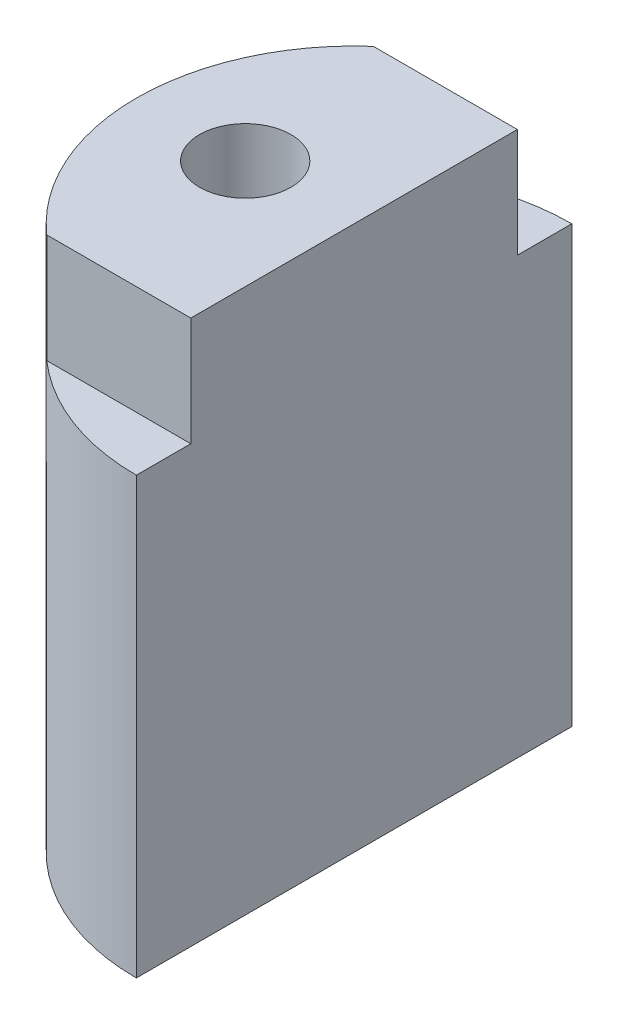
ISO-10303-21;
HEADER;
FILE_DESCRIPTION(('STEP AP214'),'2;1');
FILE_NAME('part.step','',(''),(''),'','','');
FILE_SCHEMA(('AUTOMOTIVE_DESIGN { 1 0 10303 214 1 1 1 1 }'));
ENDSEC;
DATA;
#1=APPLICATION_CONTEXT('core data for automotive mechanical design processes');
#2=APPLICATION_PROTOCOL_DEFINITION('international standard','automotive_design',2000,#1);
#3=PRODUCT_CONTEXT('',#1,'mechanical');
#4=PRODUCT('Part','Part','',(#3));
#5=PRODUCT_RELATED_PRODUCT_CATEGORY('part','',(#4));
#6=PRODUCT_DEFINITION_FORMATION('','',#4);
#7=PRODUCT_DEFINITION_CONTEXT('part definition',#1,'design');
#8=PRODUCT_DEFINITION('design','',#6,#7);
#9=PRODUCT_DEFINITION_SHAPE('','',#8);
#10=(LENGTH_UNIT() NAMED_UNIT(*) SI_UNIT(.MILLI.,.METRE.));
#11=(NAMED_UNIT(*) PLANE_ANGLE_UNIT() SI_UNIT($,.RADIAN.));
#12=(NAMED_UNIT(*) SI_UNIT($,.STERADIAN.) SOLID_ANGLE_UNIT());
#13=UNCERTAINTY_MEASURE_WITH_UNIT(LENGTH_MEASURE(1.E-05),#10,'distance_accuracy_value','');
#14=(GEOMETRIC_REPRESENTATION_CONTEXT(3) GLOBAL_UNCERTAINTY_ASSIGNED_CONTEXT((#13)) GLOBAL_UNIT_ASSIGNED_CONTEXT((#10,
#11,#12)) REPRESENTATION_CONTEXT('',''));
#15=CARTESIAN_POINT('',(0.,0.,0.));
#16=DIRECTION('',(0.,0.,1.));
#17=DIRECTION('',(1.,0.,0.));
#18=AXIS2_PLACEMENT_3D('',#15,#16,#17);
#19=CARTESIAN_POINT('',(0.,25.,0.));
#20=DIRECTION('',(0.,-1.,0.));
#21=DIRECTION('',(0.,0.,-1.));
#22=AXIS2_PLACEMENT_3D('',#19,#20,#21);
#23=CYLINDRICAL_SURFACE('',#22,10.);
#24=DIRECTION('',(0.,1.,0.));
#25=VECTOR('',#24,1.);
#26=CARTESIAN_POINT('',(-6.61437827766148,20.,-7.5));
#27=LINE('',#26,#25);
#28=CARTESIAN_POINT('',(-6.61437827766148,20.,-7.5));
#29=VERTEX_POINT('',#28);
#30=CARTESIAN_POINT('',(-6.61437827766148,25.,-7.5));
#31=VERTEX_POINT('',#30);
#32=EDGE_CURVE('E67',#29,#31,#27,.T.);
#33=ORIENTED_EDGE('',*,*,#32,.F.);
#34=CARTESIAN_POINT('',(0.,20.,0.));
#35=DIRECTION('',(0.,1.,0.));
#36=DIRECTION('',(0.,0.,1.));
#37=AXIS2_PLACEMENT_3D('',#34,#35,#36);
#38=CIRCLE('',#37,10.);
#39=CARTESIAN_POINT('',(0.,20.,-10.));
#40=VERTEX_POINT('',#39);
#41=EDGE_CURVE('E125',#40,#29,#38,.T.);
#42=ORIENTED_EDGE('',*,*,#41,.F.);
#43=DIRECTION('',(0.,-1.,0.));
#44=VECTOR('',#43,1.);
#45=CARTESIAN_POINT('',(0.,25.,-10.));
#46=LINE('',#45,#44);
#47=CARTESIAN_POINT('',(0.,0.,-10.));
#48=VERTEX_POINT('',#47);
#49=EDGE_CURVE('E52',#40,#48,#46,.T.);
#50=ORIENTED_EDGE('',*,*,#49,.T.);
#51=CARTESIAN_POINT('',(0.,0.,0.));
#52=DIRECTION('',(0.,1.,0.));
#53=DIRECTION('',(0.,0.,1.));
#54=AXIS2_PLACEMENT_3D('',#51,#52,#53);
#55=CIRCLE('',#54,10.);
#56=CARTESIAN_POINT('',(0.,0.,10.));
#57=VERTEX_POINT('',#56);
#58=EDGE_CURVE('E135',#48,#57,#55,.T.);
#59=ORIENTED_EDGE('',*,*,#58,.T.);
#60=DIRECTION('',(0.,-1.,0.));
#61=VECTOR('',#60,1.);
#62=CARTESIAN_POINT('',(0.,25.,10.));
#63=LINE('',#62,#61);
#64=CARTESIAN_POINT('',(0.,20.,10.));
#65=VERTEX_POINT('',#64);
#66=EDGE_CURVE('E11',#65,#57,#63,.T.);
#67=ORIENTED_EDGE('',*,*,#66,.F.);
#68=CARTESIAN_POINT('',(0.,20.,0.));
#69=DIRECTION('',(0.,1.,0.));
#70=DIRECTION('',(0.,0.,1.));
#71=AXIS2_PLACEMENT_3D('',#68,#69,#70);
#72=CIRCLE('',#71,10.);
#73=CARTESIAN_POINT('',(-6.61437827766148,20.,7.5));
#74=VERTEX_POINT('',#73);
#75=EDGE_CURVE('E146',#74,#65,#72,.T.);
#76=ORIENTED_EDGE('',*,*,#75,.F.);
#77=DIRECTION('',(0.,1.,0.));
#78=VECTOR('',#77,1.);
#79=CARTESIAN_POINT('',(-6.61437827766148,20.,7.5));
#80=LINE('',#79,#78);
#81=CARTESIAN_POINT('',(-6.61437827766148,25.,7.5));
#82=VERTEX_POINT('',#81);
#83=EDGE_CURVE('E132',#74,#82,#80,.T.);
#84=ORIENTED_EDGE('',*,*,#83,.T.);
#85=CARTESIAN_POINT('',(0.,25.,0.));
#86=DIRECTION('',(0.,1.,0.));
#87=DIRECTION('',(0.,0.,1.));
#88=AXIS2_PLACEMENT_3D('',#85,#86,#87);
#89=CIRCLE('',#88,10.);
#90=EDGE_CURVE('E154',#31,#82,#89,.T.);
#91=ORIENTED_EDGE('',*,*,#90,.F.);
#92=EDGE_LOOP('',(#33,#42,#50,#59,#67,#76,#84,#91));
#93=FACE_BOUND('',#92,.T.);
#94=ADVANCED_FACE('F44',(#93),#23,.T.);
#95=CARTESIAN_POINT('',(0.,25.,-10.));
#96=DIRECTION('',(-1.,0.,0.));
#97=DIRECTION('',(0.,0.,1.));
#98=AXIS2_PLACEMENT_3D('',#95,#96,#97);
#99=PLANE('',#98);
#100=DIRECTION('',(0.,1.,0.));
#101=VECTOR('',#100,1.);
#102=CARTESIAN_POINT('',(0.,20.,-7.5));
#103=LINE('',#102,#101);
#104=CARTESIAN_POINT('',(0.,20.,-7.5));
#105=VERTEX_POINT('',#104);
#106=CARTESIAN_POINT('',(0.,25.,-7.5));
#107=VERTEX_POINT('',#106);
#108=EDGE_CURVE('E129',#105,#107,#103,.T.);
#109=ORIENTED_EDGE('',*,*,#108,.T.);
#110=DIRECTION('',(0.,0.,-1.));
#111=VECTOR('',#110,1.);
#112=CARTESIAN_POINT('',(0.,25.,-10.));
#113=LINE('',#112,#111);
#114=CARTESIAN_POINT('',(0.,25.,7.5));
#115=VERTEX_POINT('',#114);
#116=EDGE_CURVE('E158',#115,#107,#113,.T.);
#117=ORIENTED_EDGE('',*,*,#116,.F.);
#118=DIRECTION('',(0.,1.,0.));
#119=VECTOR('',#118,1.);
#120=CARTESIAN_POINT('',(0.,20.,7.5));
#121=LINE('',#120,#119);
#122=CARTESIAN_POINT('',(0.,20.,7.5));
#123=VERTEX_POINT('',#122);
#124=EDGE_CURVE('E59',#123,#115,#121,.T.);
#125=ORIENTED_EDGE('',*,*,#124,.F.);
#126=DIRECTION('',(0.,0.,-1.));
#127=VECTOR('',#126,1.);
#128=CARTESIAN_POINT('',(0.,20.,0.));
#129=LINE('',#128,#127);
#130=EDGE_CURVE('E113',#65,#123,#129,.T.);
#131=ORIENTED_EDGE('',*,*,#130,.F.);
#132=ORIENTED_EDGE('',*,*,#66,.T.);
#133=DIRECTION('',(0.,0.,-1.));
#134=VECTOR('',#133,1.);
#135=CARTESIAN_POINT('',(0.,0.,-10.));
#136=LINE('',#135,#134);
#137=EDGE_CURVE('E159',#57,#48,#136,.T.);
#138=ORIENTED_EDGE('',*,*,#137,.T.);
#139=ORIENTED_EDGE('',*,*,#49,.F.);
#140=DIRECTION('',(0.,0.,-1.));
#141=VECTOR('',#140,1.);
#142=CARTESIAN_POINT('',(0.,20.,0.));
#143=LINE('',#142,#141);
#144=EDGE_CURVE('E121',#105,#40,#143,.T.);
#145=ORIENTED_EDGE('',*,*,#144,.F.);
#146=EDGE_LOOP('',(#109,#117,#125,#131,#132,#138,#139,#145));
#147=FACE_BOUND('',#146,.T.);
#148=ADVANCED_FACE('F177',(#147),#99,.F.);
#149=CARTESIAN_POINT('',(0.,25.,0.));
#150=DIRECTION('',(0.,1.,0.));
#151=DIRECTION('',(0.,0.,1.));
#152=AXIS2_PLACEMENT_3D('',#149,#150,#151);
#153=PLANE('',#152);
#154=CARTESIAN_POINT('',(-5.,25.,0.));
#155=DIRECTION('',(0.,1.,0.));
#156=DIRECTION('',(0.,0.,1.));
#157=AXIS2_PLACEMENT_3D('',#154,#155,#156);
#158=CIRCLE('',#157,2.1);
#159=CARTESIAN_POINT('',(-5.,25.,2.1));
#160=VERTEX_POINT('',#159);
#161=EDGE_CURVE('E109',#160,#160,#158,.T.);
#162=ORIENTED_EDGE('',*,*,#161,.F.);
#163=EDGE_LOOP('',(#162));
#164=FACE_BOUND('',#163,.T.);
#165=ORIENTED_EDGE('',*,*,#116,.T.);
#166=DIRECTION('',(-1.,0.,0.));
#167=VECTOR('',#166,1.);
#168=CARTESIAN_POINT('',(0.,25.,-7.5));
#169=LINE('',#168,#167);
#170=EDGE_CURVE('E122',#107,#31,#169,.T.);
#171=ORIENTED_EDGE('',*,*,#170,.T.);
#172=ORIENTED_EDGE('',*,*,#90,.T.);
#173=DIRECTION('',(-1.,0.,0.));
#174=VECTOR('',#173,1.);
#175=CARTESIAN_POINT('',(0.,25.,7.5));
#176=LINE('',#175,#174);
#177=EDGE_CURVE('E108',#115,#82,#176,.T.);
#178=ORIENTED_EDGE('',*,*,#177,.F.);
#179=EDGE_LOOP('',(#165,#171,#172,#178));
#180=FACE_BOUND('',#179,.T.);
#181=ADVANCED_FACE('F183',(#164,#180),#153,.T.);
#182=CARTESIAN_POINT('',(0.,0.,0.));
#183=DIRECTION('',(0.,1.,0.));
#184=DIRECTION('',(0.,0.,1.));
#185=AXIS2_PLACEMENT_3D('',#182,#183,#184);
#186=PLANE('',#185);
#187=ORIENTED_EDGE('',*,*,#58,.F.);
#188=ORIENTED_EDGE('',*,*,#137,.F.);
#189=EDGE_LOOP('',(#187,#188));
#190=FACE_BOUND('',#189,.T.);
#191=ADVANCED_FACE('F180',(#190),#186,.F.);
#192=CARTESIAN_POINT('',(0.,20.,7.5));
#193=DIRECTION('',(0.,0.,-1.));
#194=DIRECTION('',(-1.,0.,0.));
#195=AXIS2_PLACEMENT_3D('',#192,#193,#194);
#196=PLANE('',#195);
#197=ORIENTED_EDGE('',*,*,#177,.T.);
#198=ORIENTED_EDGE('',*,*,#83,.F.);
#199=DIRECTION('',(-1.,0.,0.));
#200=VECTOR('',#199,1.);
#201=CARTESIAN_POINT('',(0.,20.,7.5));
#202=LINE('',#201,#200);
#203=EDGE_CURVE('E142',#123,#74,#202,.T.);
#204=ORIENTED_EDGE('',*,*,#203,.F.);
#205=ORIENTED_EDGE('',*,*,#124,.T.);
#206=EDGE_LOOP('',(#197,#198,#204,#205));
#207=FACE_BOUND('',#206,.T.);
#208=ADVANCED_FACE('F182',(#207),#196,.F.);
#209=CARTESIAN_POINT('',(0.,20.,0.));
#210=DIRECTION('',(0.,1.,0.));
#211=DIRECTION('',(0.,0.,1.));
#212=AXIS2_PLACEMENT_3D('',#209,#210,#211);
#213=PLANE('',#212);
#214=ORIENTED_EDGE('',*,*,#130,.T.);
#215=ORIENTED_EDGE('',*,*,#203,.T.);
#216=ORIENTED_EDGE('',*,*,#75,.T.);
#217=EDGE_LOOP('',(#214,#215,#216));
#218=FACE_BOUND('',#217,.T.);
#219=ADVANCED_FACE('F189',(#218),#213,.T.);
#220=CARTESIAN_POINT('',(0.,20.,-7.5));
#221=DIRECTION('',(0.,0.,-1.));
#222=DIRECTION('',(-1.,0.,0.));
#223=AXIS2_PLACEMENT_3D('',#220,#221,#222);
#224=PLANE('',#223);
#225=ORIENTED_EDGE('',*,*,#170,.F.);
#226=ORIENTED_EDGE('',*,*,#108,.F.);
#227=DIRECTION('',(-1.,0.,0.));
#228=VECTOR('',#227,1.);
#229=CARTESIAN_POINT('',(0.,20.,-7.5));
#230=LINE('',#229,#228);
#231=EDGE_CURVE('E118',#105,#29,#230,.T.);
#232=ORIENTED_EDGE('',*,*,#231,.T.);
#233=ORIENTED_EDGE('',*,*,#32,.T.);
#234=EDGE_LOOP('',(#225,#226,#232,#233));
#235=FACE_BOUND('',#234,.T.);
#236=ADVANCED_FACE('F243',(#235),#224,.T.);
#237=CARTESIAN_POINT('',(0.,20.,0.));
#238=DIRECTION('',(0.,1.,0.));
#239=DIRECTION('',(0.,0.,1.));
#240=AXIS2_PLACEMENT_3D('',#237,#238,#239);
#241=PLANE('',#240);
#242=ORIENTED_EDGE('',*,*,#231,.F.);
#243=ORIENTED_EDGE('',*,*,#144,.T.);
#244=ORIENTED_EDGE('',*,*,#41,.T.);
#245=EDGE_LOOP('',(#242,#243,#244));
#246=FACE_BOUND('',#245,.T.);
#247=ADVANCED_FACE('F101',(#246),#241,.T.);
#248=CARTESIAN_POINT('',(-5.,13.8618072999579,0.));
#249=DIRECTION('',(0.,1.,0.));
#250=DIRECTION('',(0.,0.,1.));
#251=AXIS2_PLACEMENT_3D('',#248,#249,#250);
#252=CONICAL_SURFACE('',#251,2.1,1.02974425867665);
#253=CARTESIAN_POINT('',(-5.,12.6,0.));
#254=VERTEX_POINT('',#253);
#255=VERTEX_LOOP('',#254);
#256=FACE_BOUND('',#255,.T.);
#257=CARTESIAN_POINT('',(-5.,13.8618072999579,0.));
#258=DIRECTION('',(0.,1.,0.));
#259=DIRECTION('',(0.,0.,1.));
#260=AXIS2_PLACEMENT_3D('',#257,#258,#259);
#261=CIRCLE('',#260,2.1);
#262=CARTESIAN_POINT('',(-5.,13.8618072999579,2.1));
#263=VERTEX_POINT('',#262);
#264=EDGE_CURVE('E105',#263,#263,#261,.T.);
#265=ORIENTED_EDGE('',*,*,#264,.T.);
#266=EDGE_LOOP('',(#265));
#267=FACE_BOUND('',#266,.T.);
#268=ADVANCED_FACE('F97',(#256,#267),#252,.F.);
#269=CARTESIAN_POINT('',(-5.,25.,0.));
#270=DIRECTION('',(0.,1.,0.));
#271=DIRECTION('',(0.,0.,1.));
#272=AXIS2_PLACEMENT_3D('',#269,#270,#271);
#273=CYLINDRICAL_SURFACE('',#272,2.1);
#274=ORIENTED_EDGE('',*,*,#264,.F.);
#275=EDGE_LOOP('',(#274));
#276=FACE_BOUND('',#275,.T.);
#277=ORIENTED_EDGE('',*,*,#161,.T.);
#278=EDGE_LOOP('',(#277));
#279=FACE_BOUND('',#278,.T.);
#280=ADVANCED_FACE('F100',(#276,#279),#273,.F.);
#281=CLOSED_SHELL('',(#94,#148,#181,#191,#208,#219,#236,#247,#268,#280));
#282=MANIFOLD_SOLID_BREP('B2',#281);
#283=ADVANCED_BREP_SHAPE_REPRESENTATION('',(#18,#282),#14);
#284=SHAPE_DEFINITION_REPRESENTATION(#9,#283);
ENDSEC;
END-ISO-10303-21;
